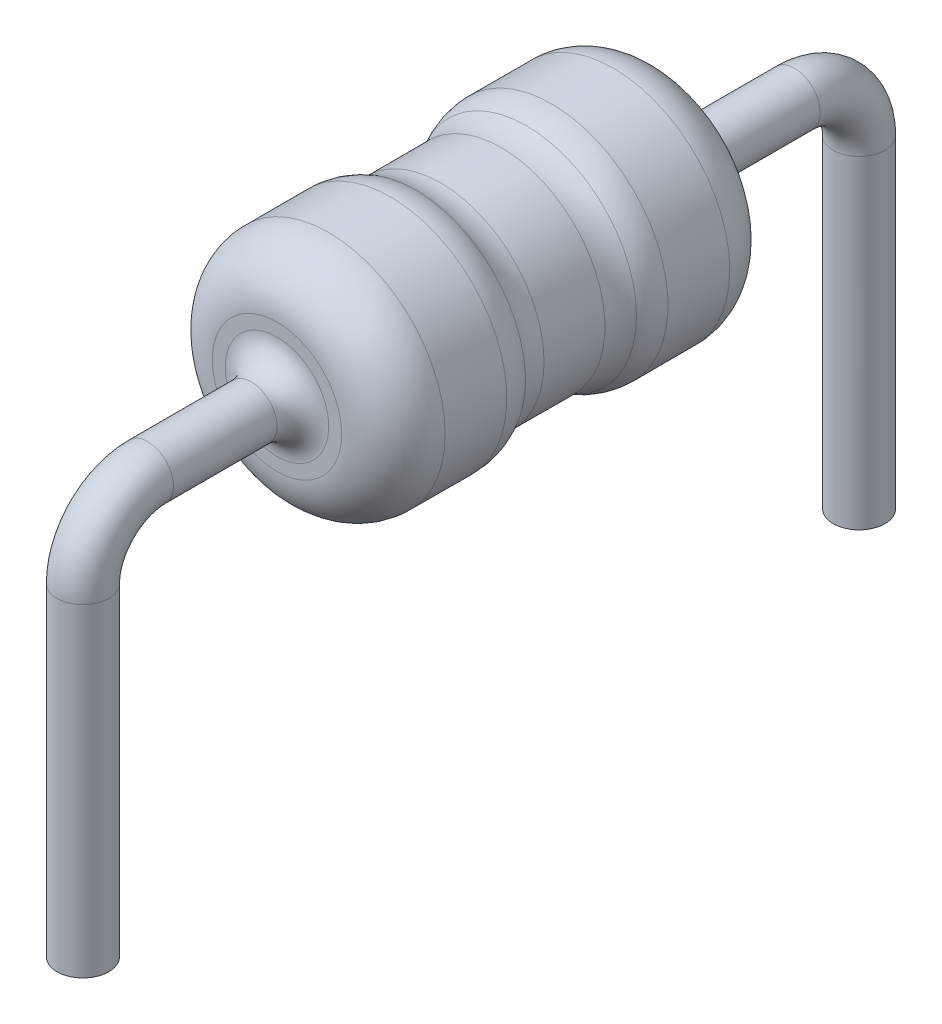
ISO-10303-21;
HEADER;
FILE_DESCRIPTION(('STEP AP214'),'2;1');
FILE_NAME('part.step','',(''),(''),'','','');
FILE_SCHEMA(('AUTOMOTIVE_DESIGN { 1 0 10303 214 1 1 1 1 }'));
ENDSEC;
DATA;
#1=APPLICATION_CONTEXT('core data for automotive mechanical design processes');
#2=APPLICATION_PROTOCOL_DEFINITION('international standard','automotive_design',2000,#1);
#3=PRODUCT_CONTEXT('',#1,'mechanical');
#4=PRODUCT('Part','Part','',(#3));
#5=PRODUCT_RELATED_PRODUCT_CATEGORY('part','',(#4));
#6=PRODUCT_DEFINITION_FORMATION('','',#4);
#7=PRODUCT_DEFINITION_CONTEXT('part definition',#1,'design');
#8=PRODUCT_DEFINITION('design','',#6,#7);
#9=PRODUCT_DEFINITION_SHAPE('','',#8);
#10=(LENGTH_UNIT() NAMED_UNIT(*) SI_UNIT(.MILLI.,.METRE.));
#11=(NAMED_UNIT(*) PLANE_ANGLE_UNIT() SI_UNIT($,.RADIAN.));
#12=(NAMED_UNIT(*) SI_UNIT($,.STERADIAN.) SOLID_ANGLE_UNIT());
#13=UNCERTAINTY_MEASURE_WITH_UNIT(LENGTH_MEASURE(1.E-05),#10,'distance_accuracy_value','');
#14=(GEOMETRIC_REPRESENTATION_CONTEXT(3) GLOBAL_UNCERTAINTY_ASSIGNED_CONTEXT((#13)) GLOBAL_UNIT_ASSIGNED_CONTEXT((#10,
#11,#12)) REPRESENTATION_CONTEXT('',''));
#15=CARTESIAN_POINT('',(0.,0.,0.));
#16=DIRECTION('',(0.,0.,1.));
#17=DIRECTION('',(1.,0.,0.));
#18=AXIS2_PLACEMENT_3D('',#15,#16,#17);
#19=CARTESIAN_POINT('',(0.,0.,0.));
#20=DIRECTION('',(0.,0.,1.));
#21=DIRECTION('',(1.,0.,0.));
#22=AXIS2_PLACEMENT_3D('',#19,#20,#21);
#23=PLANE('',#22);
#24=CARTESIAN_POINT('',(0.,0.,0.));
#25=DIRECTION('',(0.,0.,1.));
#26=DIRECTION('',(1.,0.,0.));
#27=AXIS2_PLACEMENT_3D('',#24,#25,#26);
#28=CIRCLE('',#27,0.4);
#29=CARTESIAN_POINT('',(0.4,0.,0.));
#30=VERTEX_POINT('',#29);
#31=EDGE_CURVE('E10',#30,#30,#28,.T.);
#32=ORIENTED_EDGE('',*,*,#31,.T.);
#33=EDGE_LOOP('',(#32));
#34=FACE_BOUND('',#33,.T.);
#35=CARTESIAN_POINT('',(0.,0.,0.));
#36=DIRECTION('',(0.,0.,1.));
#37=DIRECTION('',(1.,0.,0.));
#38=AXIS2_PLACEMENT_3D('',#35,#36,#37);
#39=CIRCLE('',#38,0.5);
#40=CARTESIAN_POINT('',(0.5,0.,0.));
#41=VERTEX_POINT('',#40);
#42=EDGE_CURVE('E67',#41,#41,#39,.F.);
#43=ORIENTED_EDGE('',*,*,#42,.T.);
#44=EDGE_LOOP('',(#43));
#45=FACE_BOUND('',#44,.T.);
#46=ADVANCED_FACE('F32',(#34,#45),#23,.F.);
#47=CARTESIAN_POINT('',(0.,0.,3.));
#48=DIRECTION('',(0.,0.,1.));
#49=DIRECTION('',(1.,0.,0.));
#50=AXIS2_PLACEMENT_3D('',#47,#48,#49);
#51=PLANE('',#50);
#52=CARTESIAN_POINT('',(0.,0.,3.));
#53=DIRECTION('',(0.,0.,1.));
#54=DIRECTION('',(1.,0.,0.));
#55=AXIS2_PLACEMENT_3D('',#52,#53,#54);
#56=CIRCLE('',#55,0.4);
#57=CARTESIAN_POINT('',(0.4,0.,3.));
#58=VERTEX_POINT('',#57);
#59=EDGE_CURVE('E47',#58,#58,#56,.F.);
#60=ORIENTED_EDGE('',*,*,#59,.T.);
#61=EDGE_LOOP('',(#60));
#62=FACE_BOUND('',#61,.T.);
#63=CARTESIAN_POINT('',(0.,0.,3.));
#64=DIRECTION('',(0.,0.,1.));
#65=DIRECTION('',(1.,0.,0.));
#66=AXIS2_PLACEMENT_3D('',#63,#64,#65);
#67=CIRCLE('',#66,0.5);
#68=CARTESIAN_POINT('',(0.5,0.,3.));
#69=VERTEX_POINT('',#68);
#70=EDGE_CURVE('E52',#69,#69,#67,.T.);
#71=ORIENTED_EDGE('',*,*,#70,.T.);
#72=EDGE_LOOP('',(#71));
#73=FACE_BOUND('',#72,.T.);
#74=ADVANCED_FACE('F121',(#62,#73),#51,.T.);
#75=CARTESIAN_POINT('',(0.,0.,1.));
#76=DIRECTION('',(0.,0.,-1.));
#77=DIRECTION('',(-1.,0.,0.));
#78=AXIS2_PLACEMENT_3D('',#75,#76,#77);
#79=CYLINDRICAL_SURFACE('',#78,0.9);
#80=CARTESIAN_POINT('',(0.,0.,0.4));
#81=DIRECTION('',(0.,0.,1.));
#82=DIRECTION('',(1.,0.,0.));
#83=AXIS2_PLACEMENT_3D('',#80,#81,#82);
#84=CIRCLE('',#83,0.9);
#85=CARTESIAN_POINT('',(0.9,0.,0.4));
#86=VERTEX_POINT('',#85);
#87=EDGE_CURVE('E70',#86,#86,#84,.T.);
#88=ORIENTED_EDGE('',*,*,#87,.T.);
#89=EDGE_LOOP('',(#88));
#90=FACE_BOUND('',#89,.T.);
#91=CARTESIAN_POINT('',(0.,0.,0.877276796485717));
#92=DIRECTION('',(0.,0.,-1.));
#93=DIRECTION('',(-1.,0.,0.));
#94=AXIS2_PLACEMENT_3D('',#91,#92,#93);
#95=CIRCLE('',#94,0.9);
#96=CARTESIAN_POINT('',(-0.9,0.,0.877276796485717));
#97=VERTEX_POINT('',#96);
#98=EDGE_CURVE('E73',#97,#97,#95,.T.);
#99=ORIENTED_EDGE('',*,*,#98,.T.);
#100=EDGE_LOOP('',(#99));
#101=FACE_BOUND('',#100,.T.);
#102=ADVANCED_FACE('F126',(#90,#101),#79,.T.);
#103=CARTESIAN_POINT('',(0.,0.,2.));
#104=DIRECTION('',(0.,0.,-1.));
#105=DIRECTION('',(-1.,0.,0.));
#106=AXIS2_PLACEMENT_3D('',#103,#104,#105);
#107=CYLINDRICAL_SURFACE('',#106,0.8);
#108=CARTESIAN_POINT('',(0.,0.,1.26457513110646));
#109=DIRECTION('',(0.,0.,-1.));
#110=DIRECTION('',(-1.,0.,0.));
#111=AXIS2_PLACEMENT_3D('',#108,#109,#110);
#112=CIRCLE('',#111,0.8);
#113=CARTESIAN_POINT('',(-0.8,0.,1.26457513110646));
#114=VERTEX_POINT('',#113);
#115=EDGE_CURVE('E76',#114,#114,#112,.F.);
#116=ORIENTED_EDGE('',*,*,#115,.T.);
#117=EDGE_LOOP('',(#116));
#118=FACE_BOUND('',#117,.T.);
#119=CARTESIAN_POINT('',(0.,0.,1.73542486889354));
#120=DIRECTION('',(0.,0.,1.));
#121=DIRECTION('',(1.,0.,0.));
#122=AXIS2_PLACEMENT_3D('',#119,#120,#121);
#123=CIRCLE('',#122,0.8);
#124=CARTESIAN_POINT('',(0.8,0.,1.73542486889354));
#125=VERTEX_POINT('',#124);
#126=EDGE_CURVE('E79',#125,#125,#123,.F.);
#127=ORIENTED_EDGE('',*,*,#126,.T.);
#128=EDGE_LOOP('',(#127));
#129=FACE_BOUND('',#128,.T.);
#130=ADVANCED_FACE('F132',(#118,#129),#107,.T.);
#131=CARTESIAN_POINT('',(0.,0.,3.));
#132=DIRECTION('',(0.,0.,-1.));
#133=DIRECTION('',(-1.,0.,0.));
#134=AXIS2_PLACEMENT_3D('',#131,#132,#133);
#135=CYLINDRICAL_SURFACE('',#134,0.9);
#136=CARTESIAN_POINT('',(0.,0.,2.12272320351428));
#137=DIRECTION('',(0.,0.,-1.));
#138=DIRECTION('',(-1.,0.,0.));
#139=AXIS2_PLACEMENT_3D('',#136,#137,#138);
#140=CIRCLE('',#139,0.9);
#141=CARTESIAN_POINT('',(-0.9,0.,2.12272320351428));
#142=VERTEX_POINT('',#141);
#143=EDGE_CURVE('E58',#142,#142,#140,.F.);
#144=ORIENTED_EDGE('',*,*,#143,.T.);
#145=EDGE_LOOP('',(#144));
#146=FACE_BOUND('',#145,.T.);
#147=CARTESIAN_POINT('',(0.,0.,2.6));
#148=DIRECTION('',(0.,0.,1.));
#149=DIRECTION('',(1.,0.,0.));
#150=AXIS2_PLACEMENT_3D('',#147,#148,#149);
#151=CIRCLE('',#150,0.9);
#152=CARTESIAN_POINT('',(0.9,0.,2.6));
#153=VERTEX_POINT('',#152);
#154=EDGE_CURVE('E61',#153,#153,#151,.F.);
#155=ORIENTED_EDGE('',*,*,#154,.T.);
#156=EDGE_LOOP('',(#155));
#157=FACE_BOUND('',#156,.T.);
#158=ADVANCED_FACE('F189',(#146,#157),#135,.T.);
#159=CARTESIAN_POINT('',(0.,-0.5,4.5));
#160=DIRECTION('',(0.,-1.,0.));
#161=DIRECTION('',(0.,0.,-1.));
#162=AXIS2_PLACEMENT_3D('',#159,#160,#161);
#163=CYLINDRICAL_SURFACE('',#162,0.2);
#164=CARTESIAN_POINT('',(0.,-0.5,4.5));
#165=DIRECTION('',(0.,-1.,0.));
#166=DIRECTION('',(1.,0.,0.));
#167=AXIS2_PLACEMENT_3D('',#164,#165,#166);
#168=CIRCLE('',#167,0.2);
#169=CARTESIAN_POINT('',(0.,-0.5,4.7));
#170=VERTEX_POINT('',#169);
#171=EDGE_CURVE('E85',#170,#170,#168,.T.);
#172=ORIENTED_EDGE('',*,*,#171,.T.);
#173=EDGE_LOOP('',(#172));
#174=FACE_BOUND('',#173,.T.);
#175=CARTESIAN_POINT('',(0.,-3.,4.5));
#176=DIRECTION('',(0.,-1.,0.));
#177=DIRECTION('',(1.,0.,0.));
#178=AXIS2_PLACEMENT_3D('',#175,#176,#177);
#179=CIRCLE('',#178,0.2);
#180=CARTESIAN_POINT('',(0.2,-3.,4.5));
#181=VERTEX_POINT('',#180);
#182=EDGE_CURVE('E82',#181,#181,#179,.T.);
#183=ORIENTED_EDGE('',*,*,#182,.F.);
#184=EDGE_LOOP('',(#183));
#185=FACE_BOUND('',#184,.T.);
#186=ADVANCED_FACE('F183',(#174,#185),#163,.T.);
#187=CARTESIAN_POINT('',(0.,-0.5,4.));
#188=DIRECTION('',(1.,0.,0.));
#189=DIRECTION('',(0.,0.,-1.));
#190=AXIS2_PLACEMENT_3D('',#187,#188,#189);
#191=TOROIDAL_SURFACE('',#190,0.5,0.2);
#192=CARTESIAN_POINT('',(0.,0.,4.));
#193=DIRECTION('',(0.,0.,1.));
#194=DIRECTION('',(1.,0.,0.));
#195=AXIS2_PLACEMENT_3D('',#192,#193,#194);
#196=CIRCLE('',#195,0.2);
#197=CARTESIAN_POINT('',(0.,0.2,4.));
#198=VERTEX_POINT('',#197);
#199=EDGE_CURVE('E88',#198,#198,#196,.T.);
#200=CARTESIAN_POINT('',(0.,-0.5,4.));
#201=DIRECTION('',(1.,0.,0.));
#202=DIRECTION('',(0.,0.,-1.));
#203=AXIS2_PLACEMENT_3D('',#200,#201,#202);
#204=CIRCLE('',#203,0.7);
#205=EDGE_CURVE('',#198,#170,#204,.T.);
#206=ORIENTED_EDGE('',*,*,#199,.T.);
#207=ORIENTED_EDGE('',*,*,#171,.F.);
#208=ORIENTED_EDGE('',*,*,#205,.T.);
#209=ORIENTED_EDGE('',*,*,#205,.F.);
#210=EDGE_LOOP('',(#206,#208,#207,#209));
#211=FACE_BOUND('',#210,.T.);
#212=ADVANCED_FACE('F177',(#211),#191,.T.);
#213=CARTESIAN_POINT('',(0.,0.,4.));
#214=DIRECTION('',(0.,0.,-1.));
#215=DIRECTION('',(0.,1.,0.));
#216=AXIS2_PLACEMENT_3D('',#213,#214,#215);
#217=CYLINDRICAL_SURFACE('',#216,0.2);
#218=CARTESIAN_POINT('',(0.,0.,3.2));
#219=DIRECTION('',(0.,0.,1.));
#220=DIRECTION('',(1.,0.,0.));
#221=AXIS2_PLACEMENT_3D('',#218,#219,#220);
#222=CIRCLE('',#221,0.2);
#223=CARTESIAN_POINT('',(0.2,0.,3.2));
#224=VERTEX_POINT('',#223);
#225=EDGE_CURVE('E43',#224,#224,#222,.T.);
#226=ORIENTED_EDGE('',*,*,#225,.T.);
#227=EDGE_LOOP('',(#226));
#228=FACE_BOUND('',#227,.T.);
#229=ORIENTED_EDGE('',*,*,#199,.F.);
#230=EDGE_LOOP('',(#229));
#231=FACE_BOUND('',#230,.T.);
#232=ADVANCED_FACE('F115',(#228,#231),#217,.T.);
#233=CARTESIAN_POINT('',(0.,-3.,4.5));
#234=DIRECTION('',(0.,-1.,0.));
#235=DIRECTION('',(1.,0.,0.));
#236=AXIS2_PLACEMENT_3D('',#233,#234,#235);
#237=PLANE('',#236);
#238=ORIENTED_EDGE('',*,*,#182,.T.);
#239=EDGE_LOOP('',(#238));
#240=FACE_BOUND('',#239,.T.);
#241=ADVANCED_FACE('F107',(#240),#237,.T.);
#242=CARTESIAN_POINT('',(0.,0.,-1.));
#243=DIRECTION('',(0.,0.,1.));
#244=DIRECTION('',(1.,0.,0.));
#245=AXIS2_PLACEMENT_3D('',#242,#243,#244);
#246=CYLINDRICAL_SURFACE('',#245,0.2);
#247=CARTESIAN_POINT('',(0.,0.,-0.2));
#248=DIRECTION('',(0.,0.,1.));
#249=DIRECTION('',(1.,0.,0.));
#250=AXIS2_PLACEMENT_3D('',#247,#248,#249);
#251=CIRCLE('',#250,0.2);
#252=CARTESIAN_POINT('',(0.2,0.,-0.2));
#253=VERTEX_POINT('',#252);
#254=EDGE_CURVE('E39',#253,#253,#251,.F.);
#255=ORIENTED_EDGE('',*,*,#254,.T.);
#256=EDGE_LOOP('',(#255));
#257=FACE_BOUND('',#256,.T.);
#258=CARTESIAN_POINT('',(0.,0.,-1.));
#259=DIRECTION('',(0.,0.,-1.));
#260=DIRECTION('',(-1.,0.,0.));
#261=AXIS2_PLACEMENT_3D('',#258,#259,#260);
#262=CIRCLE('',#261,0.2);
#263=CARTESIAN_POINT('',(0.,0.2,-1.));
#264=VERTEX_POINT('',#263);
#265=EDGE_CURVE('E97',#264,#264,#262,.T.);
#266=ORIENTED_EDGE('',*,*,#265,.F.);
#267=EDGE_LOOP('',(#266));
#268=FACE_BOUND('',#267,.T.);
#269=ADVANCED_FACE('F104',(#257,#268),#246,.T.);
#270=CARTESIAN_POINT('',(0.,-0.5,-1.5));
#271=DIRECTION('',(0.,-1.,0.));
#272=DIRECTION('',(0.,0.,-1.));
#273=AXIS2_PLACEMENT_3D('',#270,#271,#272);
#274=CYLINDRICAL_SURFACE('',#273,0.2);
#275=CARTESIAN_POINT('',(0.,-0.5,-1.5));
#276=DIRECTION('',(0.,-1.,0.));
#277=DIRECTION('',(-1.,0.,0.));
#278=AXIS2_PLACEMENT_3D('',#275,#276,#277);
#279=CIRCLE('',#278,0.2);
#280=CARTESIAN_POINT('',(0.,-0.5,-1.7));
#281=VERTEX_POINT('',#280);
#282=EDGE_CURVE('E94',#281,#281,#279,.T.);
#283=ORIENTED_EDGE('',*,*,#282,.T.);
#284=EDGE_LOOP('',(#283));
#285=FACE_BOUND('',#284,.T.);
#286=CARTESIAN_POINT('',(0.,-3.,-1.5));
#287=DIRECTION('',(0.,-1.,0.));
#288=DIRECTION('',(-1.,0.,0.));
#289=AXIS2_PLACEMENT_3D('',#286,#287,#288);
#290=CIRCLE('',#289,0.2);
#291=CARTESIAN_POINT('',(-0.2,-3.,-1.5));
#292=VERTEX_POINT('',#291);
#293=EDGE_CURVE('E91',#292,#292,#290,.T.);
#294=ORIENTED_EDGE('',*,*,#293,.F.);
#295=EDGE_LOOP('',(#294));
#296=FACE_BOUND('',#295,.T.);
#297=ADVANCED_FACE('F106',(#285,#296),#274,.T.);
#298=CARTESIAN_POINT('',(0.,-0.5,-1.));
#299=DIRECTION('',(-1.,0.,0.));
#300=DIRECTION('',(0.,0.,1.));
#301=AXIS2_PLACEMENT_3D('',#298,#299,#300);
#302=TOROIDAL_SURFACE('',#301,0.5,0.2);
#303=CARTESIAN_POINT('',(0.,-0.5,-1.));
#304=DIRECTION('',(-1.,0.,0.));
#305=DIRECTION('',(0.,0.,1.));
#306=AXIS2_PLACEMENT_3D('',#303,#304,#305);
#307=CIRCLE('',#306,0.7);
#308=EDGE_CURVE('',#264,#281,#307,.T.);
#309=ORIENTED_EDGE('',*,*,#265,.T.);
#310=ORIENTED_EDGE('',*,*,#282,.F.);
#311=ORIENTED_EDGE('',*,*,#308,.T.);
#312=ORIENTED_EDGE('',*,*,#308,.F.);
#313=EDGE_LOOP('',(#309,#311,#310,#312));
#314=FACE_BOUND('',#313,.T.);
#315=ADVANCED_FACE('F101',(#314),#302,.T.);
#316=CARTESIAN_POINT('',(0.,-3.,-1.5));
#317=DIRECTION('',(0.,-1.,0.));
#318=DIRECTION('',(-1.,0.,0.));
#319=AXIS2_PLACEMENT_3D('',#316,#317,#318);
#320=PLANE('',#319);
#321=ORIENTED_EDGE('',*,*,#293,.T.);
#322=EDGE_LOOP('',(#321));
#323=FACE_BOUND('',#322,.T.);
#324=ADVANCED_FACE('F141',(#323),#320,.T.);
#325=CARTESIAN_POINT('',(0.,0.,1.26457513110646));
#326=DIRECTION('',(0.,0.,-1.));
#327=DIRECTION('',(-1.,0.,0.));
#328=AXIS2_PLACEMENT_3D('',#325,#326,#327);
#329=TOROIDAL_SURFACE('',#328,1.2,0.4);
#330=CARTESIAN_POINT('',(0.,0.,1.07092596379609));
#331=DIRECTION('',(0.,0.,1.));
#332=DIRECTION('',(1.,0.,0.));
#333=AXIS2_PLACEMENT_3D('',#330,#331,#332);
#334=CIRCLE('',#333,0.85);
#335=CARTESIAN_POINT('',(0.85,0.,1.07092596379609));
#336=VERTEX_POINT('',#335);
#337=EDGE_CURVE('E64',#336,#336,#334,.T.);
#338=ORIENTED_EDGE('',*,*,#337,.T.);
#339=EDGE_LOOP('',(#338));
#340=FACE_BOUND('',#339,.T.);
#341=ORIENTED_EDGE('',*,*,#115,.F.);
#342=EDGE_LOOP('',(#341));
#343=FACE_BOUND('',#342,.T.);
#344=ADVANCED_FACE('F137',(#340,#343),#329,.F.);
#345=CARTESIAN_POINT('',(0.,0.,1.73542486889354));
#346=DIRECTION('',(0.,0.,1.));
#347=DIRECTION('',(1.,0.,0.));
#348=AXIS2_PLACEMENT_3D('',#345,#346,#347);
#349=TOROIDAL_SURFACE('',#348,1.2,0.4);
#350=CARTESIAN_POINT('',(0.,0.,1.92907403620391));
#351=DIRECTION('',(0.,0.,-1.));
#352=DIRECTION('',(-1.,0.,0.));
#353=AXIS2_PLACEMENT_3D('',#350,#351,#352);
#354=CIRCLE('',#353,0.85);
#355=CARTESIAN_POINT('',(-0.85,0.,1.92907403620391));
#356=VERTEX_POINT('',#355);
#357=EDGE_CURVE('E55',#356,#356,#354,.T.);
#358=ORIENTED_EDGE('',*,*,#357,.T.);
#359=EDGE_LOOP('',(#358));
#360=FACE_BOUND('',#359,.T.);
#361=ORIENTED_EDGE('',*,*,#126,.F.);
#362=EDGE_LOOP('',(#361));
#363=FACE_BOUND('',#362,.T.);
#364=ADVANCED_FACE('F140',(#360,#363),#349,.F.);
#365=CARTESIAN_POINT('',(0.,0.,0.4));
#366=DIRECTION('',(0.,0.,1.));
#367=DIRECTION('',(1.,0.,0.));
#368=AXIS2_PLACEMENT_3D('',#365,#366,#367);
#369=TOROIDAL_SURFACE('',#368,0.5,0.4);
#370=ORIENTED_EDGE('',*,*,#42,.F.);
#371=EDGE_LOOP('',(#370));
#372=FACE_BOUND('',#371,.T.);
#373=ORIENTED_EDGE('',*,*,#87,.F.);
#374=EDGE_LOOP('',(#373));
#375=FACE_BOUND('',#374,.T.);
#376=ADVANCED_FACE('F145',(#372,#375),#369,.T.);
#377=CARTESIAN_POINT('',(0.,0.,0.877276796485717));
#378=DIRECTION('',(0.,0.,-1.));
#379=DIRECTION('',(-1.,0.,0.));
#380=AXIS2_PLACEMENT_3D('',#377,#378,#379);
#381=TOROIDAL_SURFACE('',#380,0.5,0.4);
#382=ORIENTED_EDGE('',*,*,#98,.F.);
#383=EDGE_LOOP('',(#382));
#384=FACE_BOUND('',#383,.T.);
#385=ORIENTED_EDGE('',*,*,#337,.F.);
#386=EDGE_LOOP('',(#385));
#387=FACE_BOUND('',#386,.T.);
#388=ADVANCED_FACE('F149',(#384,#387),#381,.T.);
#389=CARTESIAN_POINT('',(0.,0.,2.12272320351428));
#390=DIRECTION('',(0.,0.,-1.));
#391=DIRECTION('',(-1.,0.,0.));
#392=AXIS2_PLACEMENT_3D('',#389,#390,#391);
#393=TOROIDAL_SURFACE('',#392,0.5,0.4);
#394=ORIENTED_EDGE('',*,*,#357,.F.);
#395=EDGE_LOOP('',(#394));
#396=FACE_BOUND('',#395,.T.);
#397=ORIENTED_EDGE('',*,*,#143,.F.);
#398=EDGE_LOOP('',(#397));
#399=FACE_BOUND('',#398,.T.);
#400=ADVANCED_FACE('F153',(#396,#399),#393,.T.);
#401=CARTESIAN_POINT('',(0.,0.,2.6));
#402=DIRECTION('',(0.,0.,1.));
#403=DIRECTION('',(1.,0.,0.));
#404=AXIS2_PLACEMENT_3D('',#401,#402,#403);
#405=TOROIDAL_SURFACE('',#404,0.5,0.4);
#406=ORIENTED_EDGE('',*,*,#154,.F.);
#407=EDGE_LOOP('',(#406));
#408=FACE_BOUND('',#407,.T.);
#409=ORIENTED_EDGE('',*,*,#70,.F.);
#410=EDGE_LOOP('',(#409));
#411=FACE_BOUND('',#410,.T.);
#412=ADVANCED_FACE('F157',(#408,#411),#405,.T.);
#413=CARTESIAN_POINT('',(0.,0.,3.2));
#414=DIRECTION('',(0.,0.,1.));
#415=DIRECTION('',(1.,0.,0.));
#416=AXIS2_PLACEMENT_3D('',#413,#414,#415);
#417=TOROIDAL_SURFACE('',#416,0.4,0.2);
#418=ORIENTED_EDGE('',*,*,#225,.F.);
#419=EDGE_LOOP('',(#418));
#420=FACE_BOUND('',#419,.T.);
#421=ORIENTED_EDGE('',*,*,#59,.F.);
#422=EDGE_LOOP('',(#421));
#423=FACE_BOUND('',#422,.T.);
#424=ADVANCED_FACE('F160',(#420,#423),#417,.F.);
#425=CARTESIAN_POINT('',(0.,0.,-0.2));
#426=DIRECTION('',(0.,0.,1.));
#427=DIRECTION('',(1.,0.,0.));
#428=AXIS2_PLACEMENT_3D('',#425,#426,#427);
#429=TOROIDAL_SURFACE('',#428,0.4,0.2);
#430=ORIENTED_EDGE('',*,*,#31,.F.);
#431=EDGE_LOOP('',(#430));
#432=FACE_BOUND('',#431,.T.);
#433=ORIENTED_EDGE('',*,*,#254,.F.);
#434=EDGE_LOOP('',(#433));
#435=FACE_BOUND('',#434,.T.);
#436=ADVANCED_FACE('F34',(#432,#435),#429,.F.);
#437=CLOSED_SHELL('',(#46,#74,#102,#130,#158,#186,#212,#232,#241,#269,#297,#315,#324,#344,#364,
#376,#388,#400,#412,#424,#436));
#438=MANIFOLD_SOLID_BREP('B2',#437);
#439=ADVANCED_BREP_SHAPE_REPRESENTATION('',(#18,#438),#14);
#440=SHAPE_DEFINITION_REPRESENTATION(#9,#439);
ENDSEC;
END-ISO-10303-21;
